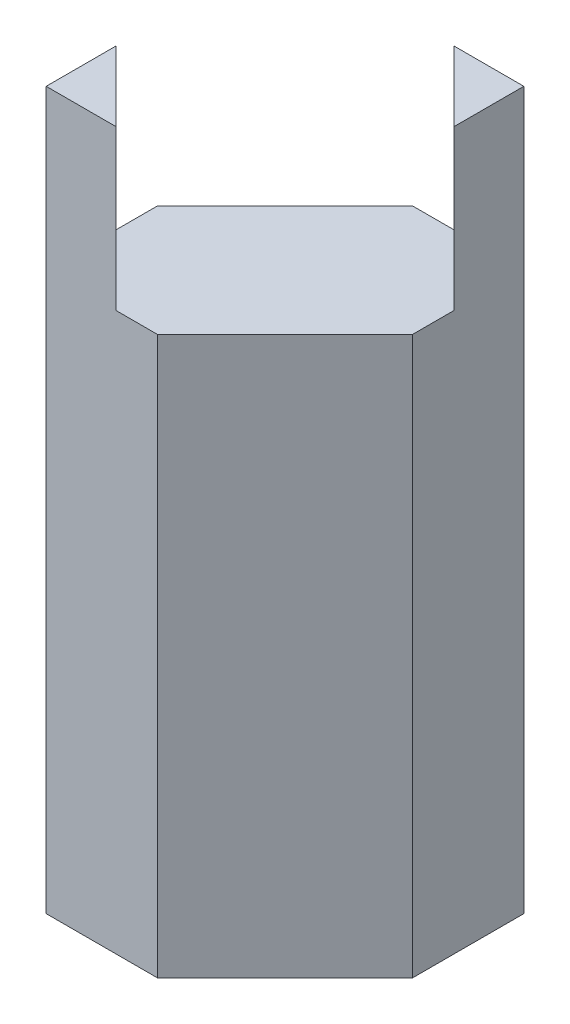
ISO-10303-21;
HEADER;
FILE_DESCRIPTION(('STEP AP214'),'2;1');
FILE_NAME('part.step','',(''),(''),'','','');
FILE_SCHEMA(('AUTOMOTIVE_DESIGN { 1 0 10303 214 1 1 1 1 }'));
ENDSEC;
DATA;
#1=APPLICATION_CONTEXT('core data for automotive mechanical design processes');
#2=APPLICATION_PROTOCOL_DEFINITION('international standard','automotive_design',2000,#1);
#3=PRODUCT_CONTEXT('',#1,'mechanical');
#4=PRODUCT('Part','Part','',(#3));
#5=PRODUCT_RELATED_PRODUCT_CATEGORY('part','',(#4));
#6=PRODUCT_DEFINITION_FORMATION('','',#4);
#7=PRODUCT_DEFINITION_CONTEXT('part definition',#1,'design');
#8=PRODUCT_DEFINITION('design','',#6,#7);
#9=PRODUCT_DEFINITION_SHAPE('','',#8);
#10=(LENGTH_UNIT() NAMED_UNIT(*) SI_UNIT(.MILLI.,.METRE.));
#11=(NAMED_UNIT(*) PLANE_ANGLE_UNIT() SI_UNIT($,.RADIAN.));
#12=(NAMED_UNIT(*) SI_UNIT($,.STERADIAN.) SOLID_ANGLE_UNIT());
#13=UNCERTAINTY_MEASURE_WITH_UNIT(LENGTH_MEASURE(1.E-05),#10,'distance_accuracy_value','');
#14=(GEOMETRIC_REPRESENTATION_CONTEXT(3) GLOBAL_UNCERTAINTY_ASSIGNED_CONTEXT((#13)) GLOBAL_UNIT_ASSIGNED_CONTEXT((#10,
#11,#12)) REPRESENTATION_CONTEXT('',''));
#15=CARTESIAN_POINT('',(0.,0.,0.));
#16=DIRECTION('',(0.,0.,1.));
#17=DIRECTION('',(1.,0.,0.));
#18=AXIS2_PLACEMENT_3D('',#15,#16,#17);
#19=CARTESIAN_POINT('',(0.,44.45,0.));
#20=DIRECTION('',(0.,-1.,0.));
#21=DIRECTION('',(0.,0.,-1.));
#22=AXIS2_PLACEMENT_3D('',#19,#20,#21);
#23=PLANE('',#22);
#24=DIRECTION('',(-0.707106781186548,0.,0.707106781186547));
#25=VECTOR('',#24,1.);
#26=CARTESIAN_POINT('',(-9.52500000000001,44.45,0.634999999999997));
#27=LINE('',#26,#25);
#28=CARTESIAN_POINT('',(0.634999999999997,44.45,-9.52500000000001));
#29=VERTEX_POINT('',#28);
#30=CARTESIAN_POINT('',(-9.52500000000001,44.45,0.634999999999997));
#31=VERTEX_POINT('',#30);
#32=EDGE_CURVE('E122',#29,#31,#27,.T.);
#33=ORIENTED_EDGE('',*,*,#32,.T.);
#34=DIRECTION('',(0.,0.,1.));
#35=VECTOR('',#34,1.);
#36=CARTESIAN_POINT('',(-9.52500000000001,44.45,9.52500000000001));
#37=LINE('',#36,#35);
#38=CARTESIAN_POINT('',(-9.52500000000001,44.45,3.95724120493712));
#39=VERTEX_POINT('',#38);
#40=EDGE_CURVE('E130',#31,#39,#37,.T.);
#41=ORIENTED_EDGE('',*,*,#40,.T.);
#42=DIRECTION('',(-0.707106781186548,0.,-0.707106781186548));
#43=VECTOR('',#42,1.);
#44=CARTESIAN_POINT('',(-3.95724120493712,44.45,9.52500000000001));
#45=LINE('',#44,#43);
#46=CARTESIAN_POINT('',(-3.95724120493712,44.45,9.52500000000001));
#47=VERTEX_POINT('',#46);
#48=EDGE_CURVE('E202',#47,#39,#45,.T.);
#49=ORIENTED_EDGE('',*,*,#48,.F.);
#50=DIRECTION('',(1.,0.,0.));
#51=VECTOR('',#50,1.);
#52=CARTESIAN_POINT('',(-9.52500000000001,44.45,9.52500000000001));
#53=LINE('',#52,#51);
#54=CARTESIAN_POINT('',(-0.635000000000024,44.45,9.52500000000001));
#55=VERTEX_POINT('',#54);
#56=EDGE_CURVE('E143',#47,#55,#53,.T.);
#57=ORIENTED_EDGE('',*,*,#56,.T.);
#58=DIRECTION('',(-0.707106781186548,0.,0.707106781186548));
#59=VECTOR('',#58,1.);
#60=CARTESIAN_POINT('',(-0.635000000000024,44.45,9.52500000000001));
#61=LINE('',#60,#59);
#62=CARTESIAN_POINT('',(9.52499999999998,44.45,-0.634999999999997));
#63=VERTEX_POINT('',#62);
#64=EDGE_CURVE('E179',#63,#55,#61,.T.);
#65=ORIENTED_EDGE('',*,*,#64,.F.);
#66=DIRECTION('',(0.,0.,-1.));
#67=VECTOR('',#66,1.);
#68=CARTESIAN_POINT('',(9.52499999999998,44.45,9.52500000000001));
#69=LINE('',#68,#67);
#70=CARTESIAN_POINT('',(9.52499999999998,44.45,-3.95724120493712));
#71=VERTEX_POINT('',#70);
#72=EDGE_CURVE('E138',#63,#71,#69,.T.);
#73=ORIENTED_EDGE('',*,*,#72,.T.);
#74=DIRECTION('',(-0.707106781186548,0.,-0.707106781186547));
#75=VECTOR('',#74,1.);
#76=CARTESIAN_POINT('',(9.52499999999998,44.45,-3.95724120493712));
#77=LINE('',#76,#75);
#78=CARTESIAN_POINT('',(3.9572412049371,44.45,-9.52500000000001));
#79=VERTEX_POINT('',#78);
#80=EDGE_CURVE('E172',#71,#79,#77,.T.);
#81=ORIENTED_EDGE('',*,*,#80,.T.);
#82=DIRECTION('',(-1.,0.,0.));
#83=VECTOR('',#82,1.);
#84=CARTESIAN_POINT('',(-9.52500000000001,44.45,-9.52500000000001));
#85=LINE('',#84,#83);
#86=EDGE_CURVE('E151',#79,#29,#85,.T.);
#87=ORIENTED_EDGE('',*,*,#86,.T.);
#88=EDGE_LOOP('',(#33,#41,#49,#57,#65,#73,#81,#87));
#89=FACE_BOUND('',#88,.T.);
#90=ADVANCED_FACE('F39',(#89),#23,.F.);
#91=CARTESIAN_POINT('',(-9.52500000000001,44.45,-9.52500000000001));
#92=DIRECTION('',(0.,0.,1.));
#93=DIRECTION('',(1.,0.,0.));
#94=AXIS2_PLACEMENT_3D('',#91,#92,#93);
#95=PLANE('',#94);
#96=DIRECTION('',(0.,1.,0.));
#97=VECTOR('',#96,1.);
#98=CARTESIAN_POINT('',(0.634999999999997,0.,-9.52500000000001));
#99=LINE('',#98,#97);
#100=CARTESIAN_POINT('',(0.634999999999997,0.,-9.52500000000001));
#101=VERTEX_POINT('',#100);
#102=EDGE_CURVE('E54',#101,#29,#99,.T.);
#103=ORIENTED_EDGE('',*,*,#102,.T.);
#104=ORIENTED_EDGE('',*,*,#86,.F.);
#105=DIRECTION('',(0.,-1.,0.));
#106=VECTOR('',#105,1.);
#107=CARTESIAN_POINT('',(3.9572412049371,57.15,-9.52500000000001));
#108=LINE('',#107,#106);
#109=CARTESIAN_POINT('',(3.9572412049371,57.15,-9.52500000000001));
#110=VERTEX_POINT('',#109);
#111=EDGE_CURVE('E177',#110,#79,#108,.T.);
#112=ORIENTED_EDGE('',*,*,#111,.F.);
#113=DIRECTION('',(1.,0.,0.));
#114=VECTOR('',#113,1.);
#115=CARTESIAN_POINT('',(3.9572412049371,57.15,-9.52500000000001));
#116=LINE('',#115,#114);
#117=CARTESIAN_POINT('',(9.52499999999998,57.15,-9.52500000000001));
#118=VERTEX_POINT('',#117);
#119=EDGE_CURVE('E189',#110,#118,#116,.T.);
#120=ORIENTED_EDGE('',*,*,#119,.T.);
#121=DIRECTION('',(0.,-1.,0.));
#122=VECTOR('',#121,1.);
#123=CARTESIAN_POINT('',(9.52499999999998,44.45,-9.52500000000001));
#124=LINE('',#123,#122);
#125=CARTESIAN_POINT('',(9.52500000000001,0.,-9.52500000000001));
#126=VERTEX_POINT('',#125);
#127=EDGE_CURVE('E11',#118,#126,#124,.T.);
#128=ORIENTED_EDGE('',*,*,#127,.T.);
#129=DIRECTION('',(-1.,0.,0.));
#130=VECTOR('',#129,1.);
#131=CARTESIAN_POINT('',(-9.52500000000001,0.,-9.52500000000001));
#132=LINE('',#131,#130);
#133=EDGE_CURVE('E136',#126,#101,#132,.T.);
#134=ORIENTED_EDGE('',*,*,#133,.T.);
#135=EDGE_LOOP('',(#103,#104,#112,#120,#128,#134));
#136=FACE_BOUND('',#135,.T.);
#137=ADVANCED_FACE('F175',(#136),#95,.F.);
#138=CARTESIAN_POINT('',(-9.52500000000001,44.45,9.52500000000001));
#139=DIRECTION('',(1.,0.,0.));
#140=DIRECTION('',(0.,0.,-1.));
#141=AXIS2_PLACEMENT_3D('',#138,#139,#140);
#142=PLANE('',#141);
#143=DIRECTION('',(0.,1.,0.));
#144=VECTOR('',#143,1.);
#145=CARTESIAN_POINT('',(-9.52500000000001,0.,0.634999999999997));
#146=LINE('',#145,#144);
#147=CARTESIAN_POINT('',(-9.52500000000001,0.,0.634999999999997));
#148=VERTEX_POINT('',#147);
#149=EDGE_CURVE('E116',#148,#31,#146,.T.);
#150=ORIENTED_EDGE('',*,*,#149,.F.);
#151=DIRECTION('',(0.,0.,1.));
#152=VECTOR('',#151,1.);
#153=CARTESIAN_POINT('',(-9.52500000000001,0.,9.52500000000001));
#154=LINE('',#153,#152);
#155=CARTESIAN_POINT('',(-9.52500000000001,0.,9.52500000000001));
#156=VERTEX_POINT('',#155);
#157=EDGE_CURVE('E127',#148,#156,#154,.T.);
#158=ORIENTED_EDGE('',*,*,#157,.T.);
#159=DIRECTION('',(0.,-1.,0.));
#160=VECTOR('',#159,1.);
#161=CARTESIAN_POINT('',(-9.52500000000001,44.45,9.52500000000001));
#162=LINE('',#161,#160);
#163=CARTESIAN_POINT('',(-9.52500000000001,57.15,9.52500000000001));
#164=VERTEX_POINT('',#163);
#165=EDGE_CURVE('E47',#164,#156,#162,.T.);
#166=ORIENTED_EDGE('',*,*,#165,.F.);
#167=DIRECTION('',(0.,0.,1.));
#168=VECTOR('',#167,1.);
#169=CARTESIAN_POINT('',(-9.52500000000001,57.15,3.95724120493712));
#170=LINE('',#169,#168);
#171=CARTESIAN_POINT('',(-9.52500000000001,57.15,3.95724120493712));
#172=VERTEX_POINT('',#171);
#173=EDGE_CURVE('E203',#172,#164,#170,.T.);
#174=ORIENTED_EDGE('',*,*,#173,.F.);
#175=DIRECTION('',(0.,-1.,0.));
#176=VECTOR('',#175,1.);
#177=CARTESIAN_POINT('',(-9.52500000000001,57.15,3.95724120493712));
#178=LINE('',#177,#176);
#179=EDGE_CURVE('E159',#172,#39,#178,.T.);
#180=ORIENTED_EDGE('',*,*,#179,.T.);
#181=ORIENTED_EDGE('',*,*,#40,.F.);
#182=EDGE_LOOP('',(#150,#158,#166,#174,#180,#181));
#183=FACE_BOUND('',#182,.T.);
#184=ADVANCED_FACE('F126',(#183),#142,.F.);
#185=CARTESIAN_POINT('',(0.,0.,0.));
#186=DIRECTION('',(0.,-1.,0.));
#187=DIRECTION('',(0.,0.,-1.));
#188=AXIS2_PLACEMENT_3D('',#185,#186,#187);
#189=PLANE('',#188);
#190=ORIENTED_EDGE('',*,*,#157,.F.);
#191=DIRECTION('',(-0.707106781186548,0.,0.707106781186547));
#192=VECTOR('',#191,1.);
#193=CARTESIAN_POINT('',(-9.52500000000001,0.,0.634999999999997));
#194=LINE('',#193,#192);
#195=EDGE_CURVE('E113',#101,#148,#194,.T.);
#196=ORIENTED_EDGE('',*,*,#195,.F.);
#197=ORIENTED_EDGE('',*,*,#133,.F.);
#198=DIRECTION('',(0.,0.,-1.));
#199=VECTOR('',#198,1.);
#200=CARTESIAN_POINT('',(9.52500000000001,0.,9.52500000000001));
#201=LINE('',#200,#199);
#202=CARTESIAN_POINT('',(9.52500000000001,0.,-0.634999999999997));
#203=VERTEX_POINT('',#202);
#204=EDGE_CURVE('E140',#203,#126,#201,.T.);
#205=ORIENTED_EDGE('',*,*,#204,.F.);
#206=DIRECTION('',(-0.707106781186548,0.,0.707106781186548));
#207=VECTOR('',#206,1.);
#208=CARTESIAN_POINT('',(-0.634999999999997,0.,9.52500000000001));
#209=LINE('',#208,#207);
#210=CARTESIAN_POINT('',(-0.634999999999997,0.,9.52500000000001));
#211=VERTEX_POINT('',#210);
#212=EDGE_CURVE('E181',#203,#211,#209,.T.);
#213=ORIENTED_EDGE('',*,*,#212,.T.);
#214=DIRECTION('',(1.,0.,0.));
#215=VECTOR('',#214,1.);
#216=CARTESIAN_POINT('',(-9.52500000000001,0.,9.52500000000001));
#217=LINE('',#216,#215);
#218=EDGE_CURVE('E135',#156,#211,#217,.T.);
#219=ORIENTED_EDGE('',*,*,#218,.F.);
#220=EDGE_LOOP('',(#190,#196,#197,#205,#213,#219));
#221=FACE_BOUND('',#220,.T.);
#222=ADVANCED_FACE('F133',(#221),#189,.T.);
#223=CARTESIAN_POINT('',(9.52499999999998,44.45,9.52500000000001));
#224=DIRECTION('',(-1.,0.,0.));
#225=DIRECTION('',(0.,0.,1.));
#226=AXIS2_PLACEMENT_3D('',#223,#224,#225);
#227=PLANE('',#226);
#228=ORIENTED_EDGE('',*,*,#72,.F.);
#229=DIRECTION('',(0.,1.,0.));
#230=VECTOR('',#229,1.);
#231=CARTESIAN_POINT('',(9.52500000000001,0.,-0.634999999999997));
#232=LINE('',#231,#230);
#233=EDGE_CURVE('E185',#203,#63,#232,.T.);
#234=ORIENTED_EDGE('',*,*,#233,.F.);
#235=ORIENTED_EDGE('',*,*,#204,.T.);
#236=ORIENTED_EDGE('',*,*,#127,.F.);
#237=DIRECTION('',(0.,0.,1.));
#238=VECTOR('',#237,1.);
#239=CARTESIAN_POINT('',(9.52499999999998,57.15,-9.52500000000001));
#240=LINE('',#239,#238);
#241=CARTESIAN_POINT('',(9.52499999999998,57.15,-3.95724120493712));
#242=VERTEX_POINT('',#241);
#243=EDGE_CURVE('E194',#118,#242,#240,.T.);
#244=ORIENTED_EDGE('',*,*,#243,.T.);
#245=DIRECTION('',(0.,-1.,0.));
#246=VECTOR('',#245,1.);
#247=CARTESIAN_POINT('',(9.52499999999998,57.15,-3.95724120493712));
#248=LINE('',#247,#246);
#249=EDGE_CURVE('E197',#242,#71,#248,.T.);
#250=ORIENTED_EDGE('',*,*,#249,.T.);
#251=EDGE_LOOP('',(#228,#234,#235,#236,#244,#250));
#252=FACE_BOUND('',#251,.T.);
#253=ADVANCED_FACE('F41',(#252),#227,.F.);
#254=CARTESIAN_POINT('',(-9.52500000000001,44.45,9.52500000000001));
#255=DIRECTION('',(0.,0.,-1.));
#256=DIRECTION('',(-1.,0.,0.));
#257=AXIS2_PLACEMENT_3D('',#254,#255,#256);
#258=PLANE('',#257);
#259=ORIENTED_EDGE('',*,*,#218,.T.);
#260=DIRECTION('',(0.,1.,0.));
#261=VECTOR('',#260,1.);
#262=CARTESIAN_POINT('',(-0.634999999999997,0.,9.52500000000001));
#263=LINE('',#262,#261);
#264=EDGE_CURVE('E62',#211,#55,#263,.T.);
#265=ORIENTED_EDGE('',*,*,#264,.T.);
#266=ORIENTED_EDGE('',*,*,#56,.F.);
#267=DIRECTION('',(0.,-1.,0.));
#268=VECTOR('',#267,1.);
#269=CARTESIAN_POINT('',(-3.95724120493715,57.15,9.52500000000001));
#270=LINE('',#269,#268);
#271=CARTESIAN_POINT('',(-3.95724120493715,57.15,9.52500000000001));
#272=VERTEX_POINT('',#271);
#273=EDGE_CURVE('E154',#272,#47,#270,.T.);
#274=ORIENTED_EDGE('',*,*,#273,.F.);
#275=DIRECTION('',(1.,0.,0.));
#276=VECTOR('',#275,1.);
#277=CARTESIAN_POINT('',(-9.52500000000001,57.15,9.52500000000001));
#278=LINE('',#277,#276);
#279=EDGE_CURVE('E206',#164,#272,#278,.T.);
#280=ORIENTED_EDGE('',*,*,#279,.F.);
#281=ORIENTED_EDGE('',*,*,#165,.T.);
#282=EDGE_LOOP('',(#259,#265,#266,#274,#280,#281));
#283=FACE_BOUND('',#282,.T.);
#284=ADVANCED_FACE('F213',(#283),#258,.F.);
#285=CARTESIAN_POINT('',(-3.95724120493715,57.15,9.52500000000001));
#286=DIRECTION('',(-0.707106781186548,0.,0.707106781186548));
#287=DIRECTION('',(0.707106781186548,0.,0.707106781186548));
#288=AXIS2_PLACEMENT_3D('',#285,#286,#287);
#289=PLANE('',#288);
#290=ORIENTED_EDGE('',*,*,#48,.T.);
#291=ORIENTED_EDGE('',*,*,#179,.F.);
#292=DIRECTION('',(-0.707106781186548,0.,-0.707106781186548));
#293=VECTOR('',#292,1.);
#294=CARTESIAN_POINT('',(-3.95724120493715,57.15,9.52500000000001));
#295=LINE('',#294,#293);
#296=EDGE_CURVE('E165',#272,#172,#295,.T.);
#297=ORIENTED_EDGE('',*,*,#296,.F.);
#298=ORIENTED_EDGE('',*,*,#273,.T.);
#299=EDGE_LOOP('',(#290,#291,#297,#298));
#300=FACE_BOUND('',#299,.T.);
#301=ADVANCED_FACE('F209',(#300),#289,.F.);
#302=CARTESIAN_POINT('',(0.,57.15,0.));
#303=DIRECTION('',(0.,1.,0.));
#304=DIRECTION('',(0.,0.,1.));
#305=AXIS2_PLACEMENT_3D('',#302,#303,#304);
#306=PLANE('',#305);
#307=ORIENTED_EDGE('',*,*,#173,.T.);
#308=ORIENTED_EDGE('',*,*,#279,.T.);
#309=ORIENTED_EDGE('',*,*,#296,.T.);
#310=EDGE_LOOP('',(#307,#308,#309));
#311=FACE_BOUND('',#310,.T.);
#312=ADVANCED_FACE('F212',(#311),#306,.T.);
#313=CARTESIAN_POINT('',(9.52499999999998,57.15,-3.95724120493712));
#314=DIRECTION('',(-0.707106781186547,0.,0.707106781186548));
#315=DIRECTION('',(0.707106781186548,0.,0.707106781186547));
#316=AXIS2_PLACEMENT_3D('',#313,#314,#315);
#317=PLANE('',#316);
#318=ORIENTED_EDGE('',*,*,#80,.F.);
#319=ORIENTED_EDGE('',*,*,#249,.F.);
#320=DIRECTION('',(-0.707106781186548,0.,-0.707106781186547));
#321=VECTOR('',#320,1.);
#322=CARTESIAN_POINT('',(9.52499999999998,57.15,-3.95724120493712));
#323=LINE('',#322,#321);
#324=EDGE_CURVE('E191',#242,#110,#323,.T.);
#325=ORIENTED_EDGE('',*,*,#324,.T.);
#326=ORIENTED_EDGE('',*,*,#111,.T.);
#327=EDGE_LOOP('',(#318,#319,#325,#326));
#328=FACE_BOUND('',#327,.T.);
#329=ADVANCED_FACE('F269',(#328),#317,.T.);
#330=CARTESIAN_POINT('',(0.,57.15,0.));
#331=DIRECTION('',(0.,1.,0.));
#332=DIRECTION('',(1.,0.,0.));
#333=AXIS2_PLACEMENT_3D('',#330,#331,#332);
#334=PLANE('',#333);
#335=ORIENTED_EDGE('',*,*,#119,.F.);
#336=ORIENTED_EDGE('',*,*,#324,.F.);
#337=ORIENTED_EDGE('',*,*,#243,.F.);
#338=EDGE_LOOP('',(#335,#336,#337));
#339=FACE_BOUND('',#338,.T.);
#340=ADVANCED_FACE('F260',(#339),#334,.T.);
#341=CARTESIAN_POINT('',(-0.634999999999997,0.,9.52500000000001));
#342=DIRECTION('',(-0.707106781186547,0.,-0.707106781186547));
#343=DIRECTION('',(-0.707106781186548,0.,0.707106781186548));
#344=AXIS2_PLACEMENT_3D('',#341,#342,#343);
#345=PLANE('',#344);
#346=ORIENTED_EDGE('',*,*,#64,.T.);
#347=ORIENTED_EDGE('',*,*,#264,.F.);
#348=ORIENTED_EDGE('',*,*,#212,.F.);
#349=ORIENTED_EDGE('',*,*,#233,.T.);
#350=EDGE_LOOP('',(#346,#347,#348,#349));
#351=FACE_BOUND('',#350,.T.);
#352=ADVANCED_FACE('F253',(#351),#345,.F.);
#353=CARTESIAN_POINT('',(-9.52500000000001,0.,0.634999999999997));
#354=DIRECTION('',(-0.707106781186547,0.,-0.707106781186548));
#355=DIRECTION('',(-0.707106781186548,0.,0.707106781186547));
#356=AXIS2_PLACEMENT_3D('',#353,#354,#355);
#357=PLANE('',#356);
#358=ORIENTED_EDGE('',*,*,#32,.F.);
#359=ORIENTED_EDGE('',*,*,#102,.F.);
#360=ORIENTED_EDGE('',*,*,#195,.T.);
#361=ORIENTED_EDGE('',*,*,#149,.T.);
#362=EDGE_LOOP('',(#358,#359,#360,#361));
#363=FACE_BOUND('',#362,.T.);
#364=ADVANCED_FACE('F115',(#363),#357,.T.);
#365=CLOSED_SHELL('',(#90,#137,#184,#222,#253,#284,#301,#312,#329,#340,#352,#364));
#366=MANIFOLD_SOLID_BREP('B2',#365);
#367=ADVANCED_BREP_SHAPE_REPRESENTATION('',(#18,#366),#14);
#368=SHAPE_DEFINITION_REPRESENTATION(#9,#367);
ENDSEC;
END-ISO-10303-21;
